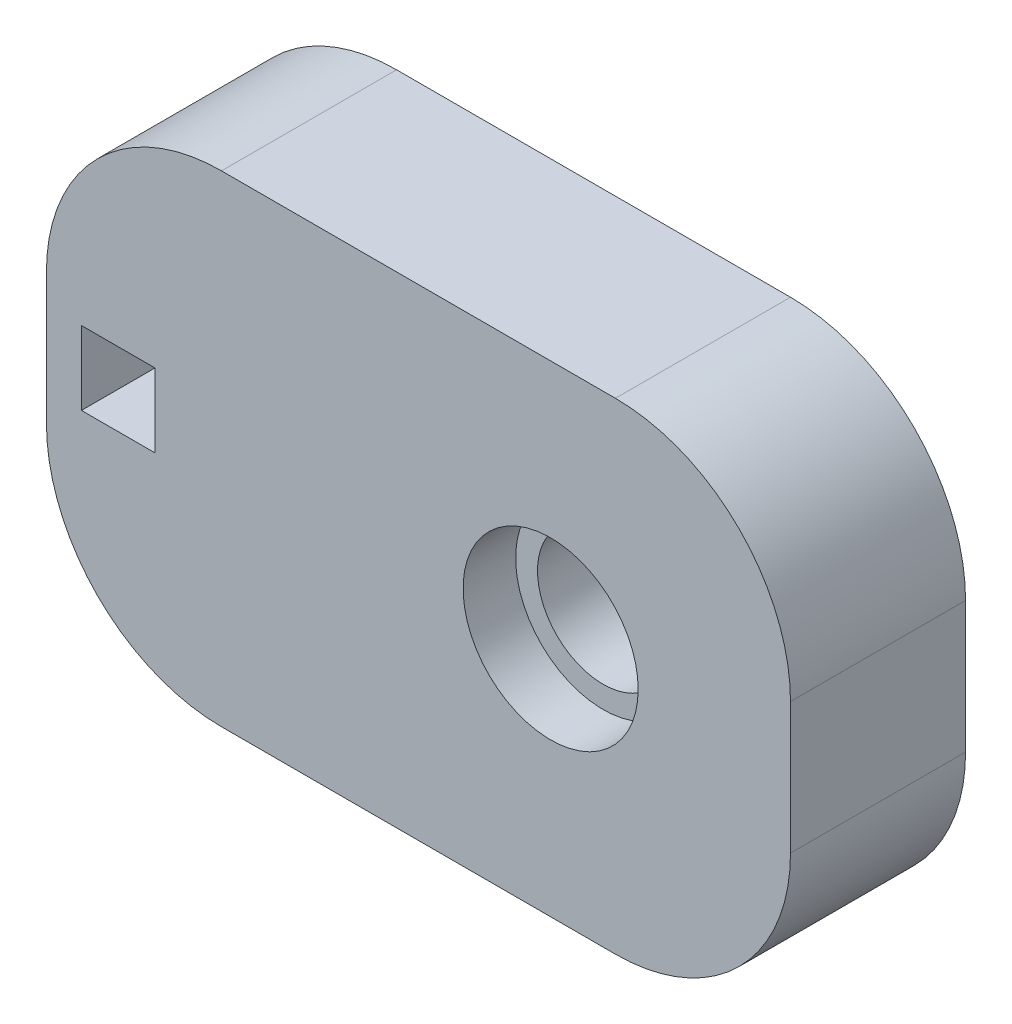
ISO-10303-21;
HEADER;
FILE_DESCRIPTION(('STEP AP214'),'2;1');
FILE_NAME('part.step','',(''),(''),'','','');
FILE_SCHEMA(('AUTOMOTIVE_DESIGN { 1 0 10303 214 1 1 1 1 }'));
ENDSEC;
DATA;
#1=APPLICATION_CONTEXT('core data for automotive mechanical design processes');
#2=APPLICATION_PROTOCOL_DEFINITION('international standard','automotive_design',2000,#1);
#3=PRODUCT_CONTEXT('',#1,'mechanical');
#4=PRODUCT('Part','Part','',(#3));
#5=PRODUCT_RELATED_PRODUCT_CATEGORY('part','',(#4));
#6=PRODUCT_DEFINITION_FORMATION('','',#4);
#7=PRODUCT_DEFINITION_CONTEXT('part definition',#1,'design');
#8=PRODUCT_DEFINITION('design','',#6,#7);
#9=PRODUCT_DEFINITION_SHAPE('','',#8);
#10=(LENGTH_UNIT() NAMED_UNIT(*) SI_UNIT(.MILLI.,.METRE.));
#11=(NAMED_UNIT(*) PLANE_ANGLE_UNIT() SI_UNIT($,.RADIAN.));
#12=(NAMED_UNIT(*) SI_UNIT($,.STERADIAN.) SOLID_ANGLE_UNIT());
#13=UNCERTAINTY_MEASURE_WITH_UNIT(LENGTH_MEASURE(1.E-05),#10,'distance_accuracy_value','');
#14=(GEOMETRIC_REPRESENTATION_CONTEXT(3) GLOBAL_UNCERTAINTY_ASSIGNED_CONTEXT((#13)) GLOBAL_UNIT_ASSIGNED_CONTEXT((#10,
#11,#12)) REPRESENTATION_CONTEXT('',''));
#15=CARTESIAN_POINT('',(0.,0.,0.));
#16=DIRECTION('',(0.,0.,1.));
#17=DIRECTION('',(1.,0.,0.));
#18=AXIS2_PLACEMENT_3D('',#15,#16,#17);
#19=CARTESIAN_POINT('',(303.925597792116,-212.008680098977,10.));
#20=DIRECTION('',(0.,1.,0.));
#21=DIRECTION('',(0.,0.,1.));
#22=AXIS2_PLACEMENT_3D('',#19,#20,#21);
#23=PLANE('',#22);
#24=DIRECTION('',(1.,0.,0.));
#25=VECTOR('',#24,1.);
#26=CARTESIAN_POINT('',(303.925597792116,-212.008680098977,10.));
#27=LINE('',#26,#25);
#28=CARTESIAN_POINT('',(313.925597792116,-212.008680098977,10.));
#29=VERTEX_POINT('',#28);
#30=CARTESIAN_POINT('',(336.425597792117,-212.008680098977,10.));
#31=VERTEX_POINT('',#30);
#32=EDGE_CURVE('E180',#29,#31,#27,.T.);
#33=ORIENTED_EDGE('',*,*,#32,.T.);
#34=DIRECTION('',(0.,0.,-1.));
#35=VECTOR('',#34,1.);
#36=CARTESIAN_POINT('',(336.425597792117,-212.008680098977,10.));
#37=LINE('',#36,#35);
#38=CARTESIAN_POINT('',(336.425597792117,-212.008680098977,0.));
#39=VERTEX_POINT('',#38);
#40=EDGE_CURVE('E230',#31,#39,#37,.T.);
#41=ORIENTED_EDGE('',*,*,#40,.T.);
#42=DIRECTION('',(1.,0.,0.));
#43=VECTOR('',#42,1.);
#44=CARTESIAN_POINT('',(303.925597792116,-212.008680098977,0.));
#45=LINE('',#44,#43);
#46=CARTESIAN_POINT('',(313.925597792116,-212.008680098977,0.));
#47=VERTEX_POINT('',#46);
#48=EDGE_CURVE('E177',#47,#39,#45,.T.);
#49=ORIENTED_EDGE('',*,*,#48,.F.);
#50=DIRECTION('',(0.,0.,-1.));
#51=VECTOR('',#50,1.);
#52=CARTESIAN_POINT('',(313.925597792116,-212.008680098977,10.));
#53=LINE('',#52,#51);
#54=EDGE_CURVE('E228',#47,#29,#53,.F.);
#55=ORIENTED_EDGE('',*,*,#54,.T.);
#56=EDGE_LOOP('',(#33,#41,#49,#55));
#57=FACE_BOUND('',#56,.T.);
#58=ADVANCED_FACE('F39',(#57),#23,.T.);
#59=CARTESIAN_POINT('',(303.925597792116,-212.008680098977,10.));
#60=DIRECTION('',(1.,0.,0.));
#61=DIRECTION('',(0.,0.,-1.));
#62=AXIS2_PLACEMENT_3D('',#59,#60,#61);
#63=PLANE('',#62);
#64=DIRECTION('',(0.,-1.,0.));
#65=VECTOR('',#64,1.);
#66=CARTESIAN_POINT('',(303.925597792116,-212.008680098977,0.));
#67=LINE('',#66,#65);
#68=CARTESIAN_POINT('',(303.925597792116,-222.008680098977,0.));
#69=VERTEX_POINT('',#68);
#70=CARTESIAN_POINT('',(303.925597792116,-229.508680098977,0.));
#71=VERTEX_POINT('',#70);
#72=EDGE_CURVE('E184',#69,#71,#67,.T.);
#73=ORIENTED_EDGE('',*,*,#72,.T.);
#74=DIRECTION('',(0.,0.,-1.));
#75=VECTOR('',#74,1.);
#76=CARTESIAN_POINT('',(303.925597792116,-229.508680098977,10.));
#77=LINE('',#76,#75);
#78=CARTESIAN_POINT('',(303.925597792116,-229.508680098977,10.));
#79=VERTEX_POINT('',#78);
#80=EDGE_CURVE('E12',#71,#79,#77,.F.);
#81=ORIENTED_EDGE('',*,*,#80,.T.);
#82=DIRECTION('',(0.,-1.,0.));
#83=VECTOR('',#82,1.);
#84=CARTESIAN_POINT('',(303.925597792116,-212.008680098977,10.));
#85=LINE('',#84,#83);
#86=CARTESIAN_POINT('',(303.925597792116,-222.008680098977,10.));
#87=VERTEX_POINT('',#86);
#88=EDGE_CURVE('E190',#87,#79,#85,.T.);
#89=ORIENTED_EDGE('',*,*,#88,.F.);
#90=DIRECTION('',(0.,0.,-1.));
#91=VECTOR('',#90,1.);
#92=CARTESIAN_POINT('',(303.925597792116,-222.008680098977,0.));
#93=LINE('',#92,#91);
#94=EDGE_CURVE('E47',#87,#69,#93,.T.);
#95=ORIENTED_EDGE('',*,*,#94,.T.);
#96=EDGE_LOOP('',(#73,#81,#89,#95));
#97=FACE_BOUND('',#96,.T.);
#98=ADVANCED_FACE('F235',(#97),#63,.F.);
#99=CARTESIAN_POINT('',(303.925597792116,-239.508680098977,10.));
#100=DIRECTION('',(0.,1.,0.));
#101=DIRECTION('',(0.,0.,1.));
#102=AXIS2_PLACEMENT_3D('',#99,#100,#101);
#103=PLANE('',#102);
#104=DIRECTION('',(1.,0.,0.));
#105=VECTOR('',#104,1.);
#106=CARTESIAN_POINT('',(303.925597792116,-239.508680098977,0.));
#107=LINE('',#106,#105);
#108=CARTESIAN_POINT('',(313.925597792116,-239.508680098977,0.));
#109=VERTEX_POINT('',#108);
#110=CARTESIAN_POINT('',(336.425597792117,-239.508680098977,0.));
#111=VERTEX_POINT('',#110);
#112=EDGE_CURVE('E198',#109,#111,#107,.T.);
#113=ORIENTED_EDGE('',*,*,#112,.T.);
#114=DIRECTION('',(0.,0.,-1.));
#115=VECTOR('',#114,1.);
#116=CARTESIAN_POINT('',(336.425597792117,-239.508680098977,10.));
#117=LINE('',#116,#115);
#118=CARTESIAN_POINT('',(336.425597792117,-239.508680098977,10.));
#119=VERTEX_POINT('',#118);
#120=EDGE_CURVE('E219',#111,#119,#117,.F.);
#121=ORIENTED_EDGE('',*,*,#120,.T.);
#122=DIRECTION('',(1.,0.,0.));
#123=VECTOR('',#122,1.);
#124=CARTESIAN_POINT('',(303.925597792116,-239.508680098977,10.));
#125=LINE('',#124,#123);
#126=CARTESIAN_POINT('',(313.925597792116,-239.508680098977,10.));
#127=VERTEX_POINT('',#126);
#128=EDGE_CURVE('E187',#127,#119,#125,.T.);
#129=ORIENTED_EDGE('',*,*,#128,.F.);
#130=DIRECTION('',(0.,0.,-1.));
#131=VECTOR('',#130,1.);
#132=CARTESIAN_POINT('',(313.925597792116,-239.508680098977,10.));
#133=LINE('',#132,#131);
#134=EDGE_CURVE('E216',#127,#109,#133,.T.);
#135=ORIENTED_EDGE('',*,*,#134,.T.);
#136=EDGE_LOOP('',(#113,#121,#129,#135));
#137=FACE_BOUND('',#136,.T.);
#138=ADVANCED_FACE('F247',(#137),#103,.F.);
#139=CARTESIAN_POINT('',(346.425597792117,-212.008680098977,10.));
#140=DIRECTION('',(1.,0.,0.));
#141=DIRECTION('',(0.,0.,-1.));
#142=AXIS2_PLACEMENT_3D('',#139,#140,#141);
#143=PLANE('',#142);
#144=DIRECTION('',(0.,-1.,0.));
#145=VECTOR('',#144,1.);
#146=CARTESIAN_POINT('',(346.425597792117,-212.008680098977,10.));
#147=LINE('',#146,#145);
#148=CARTESIAN_POINT('',(346.425597792117,-222.008680098977,10.));
#149=VERTEX_POINT('',#148);
#150=CARTESIAN_POINT('',(346.425597792117,-229.508680098977,10.));
#151=VERTEX_POINT('',#150);
#152=EDGE_CURVE('E183',#149,#151,#147,.T.);
#153=ORIENTED_EDGE('',*,*,#152,.T.);
#154=DIRECTION('',(0.,0.,-1.));
#155=VECTOR('',#154,1.);
#156=CARTESIAN_POINT('',(346.425597792117,-229.508680098977,0.));
#157=LINE('',#156,#155);
#158=CARTESIAN_POINT('',(346.425597792117,-229.508680098977,0.));
#159=VERTEX_POINT('',#158);
#160=EDGE_CURVE('E205',#151,#159,#157,.T.);
#161=ORIENTED_EDGE('',*,*,#160,.T.);
#162=DIRECTION('',(0.,-1.,0.));
#163=VECTOR('',#162,1.);
#164=CARTESIAN_POINT('',(346.425597792117,-212.008680098977,0.));
#165=LINE('',#164,#163);
#166=CARTESIAN_POINT('',(346.425597792117,-222.008680098977,0.));
#167=VERTEX_POINT('',#166);
#168=EDGE_CURVE('E195',#167,#159,#165,.T.);
#169=ORIENTED_EDGE('',*,*,#168,.F.);
#170=DIRECTION('',(0.,0.,-1.));
#171=VECTOR('',#170,1.);
#172=CARTESIAN_POINT('',(346.425597792117,-222.008680098977,10.));
#173=LINE('',#172,#171);
#174=EDGE_CURVE('E192',#167,#149,#173,.F.);
#175=ORIENTED_EDGE('',*,*,#174,.T.);
#176=EDGE_LOOP('',(#153,#161,#169,#175));
#177=FACE_BOUND('',#176,.T.);
#178=ADVANCED_FACE('F257',(#177),#143,.T.);
#179=CARTESIAN_POINT('',(0.,0.,10.));
#180=DIRECTION('',(0.,0.,-1.));
#181=DIRECTION('',(-1.,0.,0.));
#182=AXIS2_PLACEMENT_3D('',#179,#180,#181);
#183=PLANE('',#182);
#184=DIRECTION('',(1.,0.,0.));
#185=VECTOR('',#184,1.);
#186=CARTESIAN_POINT('',(305.925597792116,-227.858680098977,10.));
#187=LINE('',#186,#185);
#188=CARTESIAN_POINT('',(305.925597792116,-227.858680098977,10.));
#189=VERTEX_POINT('',#188);
#190=CARTESIAN_POINT('',(310.125597792116,-227.858680098977,10.));
#191=VERTEX_POINT('',#190);
#192=EDGE_CURVE('E163',#189,#191,#187,.T.);
#193=ORIENTED_EDGE('',*,*,#192,.F.);
#194=DIRECTION('',(0.,-1.,0.));
#195=VECTOR('',#194,1.);
#196=CARTESIAN_POINT('',(305.925597792116,-223.658680098977,10.));
#197=LINE('',#196,#195);
#198=CARTESIAN_POINT('',(305.925597792116,-223.658680098977,10.));
#199=VERTEX_POINT('',#198);
#200=EDGE_CURVE('E135',#199,#189,#197,.T.);
#201=ORIENTED_EDGE('',*,*,#200,.F.);
#202=DIRECTION('',(-1.,0.,0.));
#203=VECTOR('',#202,1.);
#204=CARTESIAN_POINT('',(310.125597792116,-223.658680098977,10.));
#205=LINE('',#204,#203);
#206=CARTESIAN_POINT('',(310.125597792116,-223.658680098977,10.));
#207=VERTEX_POINT('',#206);
#208=EDGE_CURVE('E152',#207,#199,#205,.T.);
#209=ORIENTED_EDGE('',*,*,#208,.F.);
#210=DIRECTION('',(0.,1.,0.));
#211=VECTOR('',#210,1.);
#212=CARTESIAN_POINT('',(310.125597792116,-227.858680098977,10.));
#213=LINE('',#212,#211);
#214=EDGE_CURVE('E155',#191,#207,#213,.T.);
#215=ORIENTED_EDGE('',*,*,#214,.F.);
#216=EDGE_LOOP('',(#193,#201,#209,#215));
#217=FACE_BOUND('',#216,.T.);
#218=CARTESIAN_POINT('',(332.725597792119,-225.758680098977,10.));
#219=DIRECTION('',(0.,0.,1.));
#220=DIRECTION('',(1.,0.,0.));
#221=AXIS2_PLACEMENT_3D('',#218,#219,#220);
#222=CIRCLE('',#221,4.9999999999961);
#223=CARTESIAN_POINT('',(337.725597792115,-225.758680098977,10.));
#224=VERTEX_POINT('',#223);
#225=EDGE_CURVE('E170',#224,#224,#222,.T.);
#226=ORIENTED_EDGE('',*,*,#225,.F.);
#227=EDGE_LOOP('',(#226));
#228=FACE_BOUND('',#227,.T.);
#229=ORIENTED_EDGE('',*,*,#128,.T.);
#230=CARTESIAN_POINT('',(336.425597792117,-229.508680098977,10.));
#231=DIRECTION('',(0.,0.,-1.));
#232=DIRECTION('',(-1.,0.,0.));
#233=AXIS2_PLACEMENT_3D('',#230,#231,#232);
#234=CIRCLE('',#233,10.);
#235=EDGE_CURVE('E226',#119,#151,#234,.F.);
#236=ORIENTED_EDGE('',*,*,#235,.T.);
#237=ORIENTED_EDGE('',*,*,#152,.F.);
#238=CARTESIAN_POINT('',(336.425597792117,-222.008680098977,10.));
#239=DIRECTION('',(0.,0.,-1.));
#240=DIRECTION('',(-1.,0.,0.));
#241=AXIS2_PLACEMENT_3D('',#238,#239,#240);
#242=CIRCLE('',#241,10.);
#243=EDGE_CURVE('E224',#149,#31,#242,.F.);
#244=ORIENTED_EDGE('',*,*,#243,.T.);
#245=ORIENTED_EDGE('',*,*,#32,.F.);
#246=CARTESIAN_POINT('',(313.925597792116,-222.008680098977,10.));
#247=DIRECTION('',(0.,0.,-1.));
#248=DIRECTION('',(-1.,0.,0.));
#249=AXIS2_PLACEMENT_3D('',#246,#247,#248);
#250=CIRCLE('',#249,10.);
#251=EDGE_CURVE('E59',#29,#87,#250,.F.);
#252=ORIENTED_EDGE('',*,*,#251,.T.);
#253=ORIENTED_EDGE('',*,*,#88,.T.);
#254=CARTESIAN_POINT('',(313.925597792116,-229.508680098977,10.));
#255=DIRECTION('',(0.,0.,-1.));
#256=DIRECTION('',(-1.,0.,0.));
#257=AXIS2_PLACEMENT_3D('',#254,#255,#256);
#258=CIRCLE('',#257,10.);
#259=EDGE_CURVE('E222',#79,#127,#258,.F.);
#260=ORIENTED_EDGE('',*,*,#259,.T.);
#261=EDGE_LOOP('',(#229,#236,#237,#244,#245,#252,#253,#260));
#262=FACE_BOUND('',#261,.T.);
#263=ADVANCED_FACE('F250',(#217,#228,#262),#183,.F.);
#264=CARTESIAN_POINT('',(0.,0.,0.));
#265=DIRECTION('',(0.,0.,-1.));
#266=DIRECTION('',(-1.,0.,0.));
#267=AXIS2_PLACEMENT_3D('',#264,#265,#266);
#268=PLANE('',#267);
#269=ORIENTED_EDGE('',*,*,#168,.T.);
#270=CARTESIAN_POINT('',(336.425597792117,-229.508680098977,0.));
#271=DIRECTION('',(0.,0.,-1.));
#272=DIRECTION('',(-1.,0.,0.));
#273=AXIS2_PLACEMENT_3D('',#270,#271,#272);
#274=CIRCLE('',#273,10.);
#275=EDGE_CURVE('E214',#159,#111,#274,.T.);
#276=ORIENTED_EDGE('',*,*,#275,.T.);
#277=ORIENTED_EDGE('',*,*,#112,.F.);
#278=CARTESIAN_POINT('',(313.925597792116,-229.508680098977,0.));
#279=DIRECTION('',(0.,0.,-1.));
#280=DIRECTION('',(-1.,0.,0.));
#281=AXIS2_PLACEMENT_3D('',#278,#279,#280);
#282=CIRCLE('',#281,10.);
#283=EDGE_CURVE('E210',#109,#71,#282,.T.);
#284=ORIENTED_EDGE('',*,*,#283,.T.);
#285=ORIENTED_EDGE('',*,*,#72,.F.);
#286=CARTESIAN_POINT('',(313.925597792116,-222.008680098977,0.));
#287=DIRECTION('',(0.,0.,-1.));
#288=DIRECTION('',(-1.,0.,0.));
#289=AXIS2_PLACEMENT_3D('',#286,#287,#288);
#290=CIRCLE('',#289,10.);
#291=EDGE_CURVE('E208',#69,#47,#290,.T.);
#292=ORIENTED_EDGE('',*,*,#291,.T.);
#293=ORIENTED_EDGE('',*,*,#48,.T.);
#294=CARTESIAN_POINT('',(336.425597792117,-222.008680098977,0.));
#295=DIRECTION('',(0.,0.,-1.));
#296=DIRECTION('',(-1.,0.,0.));
#297=AXIS2_PLACEMENT_3D('',#294,#295,#296);
#298=CIRCLE('',#297,10.);
#299=EDGE_CURVE('E212',#39,#167,#298,.T.);
#300=ORIENTED_EDGE('',*,*,#299,.T.);
#301=EDGE_LOOP('',(#269,#276,#277,#284,#285,#292,#293,#300));
#302=FACE_BOUND('',#301,.T.);
#303=ADVANCED_FACE('F238',(#302),#268,.T.);
#304=CARTESIAN_POINT('',(332.725597792119,-225.758680098977,7.));
#305=DIRECTION('',(0.,0.,1.));
#306=DIRECTION('',(1.,0.,0.));
#307=AXIS2_PLACEMENT_3D('',#304,#305,#306);
#308=CYLINDRICAL_SURFACE('',#307,4.9999999999961);
#309=CARTESIAN_POINT('',(332.725597792119,-225.758680098977,7.));
#310=DIRECTION('',(0.,0.,1.));
#311=DIRECTION('',(1.,0.,0.));
#312=AXIS2_PLACEMENT_3D('',#309,#310,#311);
#313=CIRCLE('',#312,4.9999999999961);
#314=CARTESIAN_POINT('',(337.725597792115,-225.758680098977,7.));
#315=VERTEX_POINT('',#314);
#316=EDGE_CURVE('E174',#315,#315,#313,.T.);
#317=ORIENTED_EDGE('',*,*,#316,.F.);
#318=EDGE_LOOP('',(#317));
#319=FACE_BOUND('',#318,.T.);
#320=ORIENTED_EDGE('',*,*,#225,.T.);
#321=EDGE_LOOP('',(#320));
#322=FACE_BOUND('',#321,.T.);
#323=ADVANCED_FACE('F380',(#319,#322),#308,.F.);
#324=CARTESIAN_POINT('',(332.725597792119,-225.758680098977,7.));
#325=DIRECTION('',(0.,0.,1.));
#326=DIRECTION('',(1.,0.,0.));
#327=AXIS2_PLACEMENT_3D('',#324,#325,#326);
#328=PLANE('',#327);
#329=CARTESIAN_POINT('',(332.725597792119,-225.758680098977,7.));
#330=DIRECTION('',(0.,0.,1.));
#331=DIRECTION('',(1.,0.,0.));
#332=AXIS2_PLACEMENT_3D('',#329,#330,#331);
#333=CIRCLE('',#332,3.74999999999998);
#334=CARTESIAN_POINT('',(336.475597792119,-225.758680098977,7.));
#335=VERTEX_POINT('',#334);
#336=EDGE_CURVE('E164',#335,#335,#333,.T.);
#337=ORIENTED_EDGE('',*,*,#336,.F.);
#338=EDGE_LOOP('',(#337));
#339=FACE_BOUND('',#338,.T.);
#340=ORIENTED_EDGE('',*,*,#316,.T.);
#341=EDGE_LOOP('',(#340));
#342=FACE_BOUND('',#341,.T.);
#343=ADVANCED_FACE('F371',(#339,#342),#328,.T.);
#344=CARTESIAN_POINT('',(305.925597792116,-223.658680098977,5.));
#345=DIRECTION('',(-1.,0.,0.));
#346=DIRECTION('',(0.,0.,1.));
#347=AXIS2_PLACEMENT_3D('',#344,#345,#346);
#348=PLANE('',#347);
#349=ORIENTED_EDGE('',*,*,#200,.T.);
#350=DIRECTION('',(0.,0.,1.));
#351=VECTOR('',#350,1.);
#352=CARTESIAN_POINT('',(305.925597792116,-227.858680098977,5.));
#353=LINE('',#352,#351);
#354=CARTESIAN_POINT('',(305.925597792116,-227.858680098977,5.));
#355=VERTEX_POINT('',#354);
#356=EDGE_CURVE('E128',#355,#189,#353,.T.);
#357=ORIENTED_EDGE('',*,*,#356,.F.);
#358=DIRECTION('',(0.,-1.,0.));
#359=VECTOR('',#358,1.);
#360=CARTESIAN_POINT('',(305.925597792116,-223.658680098977,5.));
#361=LINE('',#360,#359);
#362=CARTESIAN_POINT('',(305.925597792116,-223.658680098977,5.));
#363=VERTEX_POINT('',#362);
#364=EDGE_CURVE('E132',#363,#355,#361,.T.);
#365=ORIENTED_EDGE('',*,*,#364,.F.);
#366=DIRECTION('',(0.,0.,1.));
#367=VECTOR('',#366,1.);
#368=CARTESIAN_POINT('',(305.925597792116,-223.658680098977,5.));
#369=LINE('',#368,#367);
#370=EDGE_CURVE('E168',#363,#199,#369,.T.);
#371=ORIENTED_EDGE('',*,*,#370,.T.);
#372=EDGE_LOOP('',(#349,#357,#365,#371));
#373=FACE_BOUND('',#372,.T.);
#374=ADVANCED_FACE('F130',(#373),#348,.F.);
#375=CARTESIAN_POINT('',(310.125597792116,-223.658680098977,5.));
#376=DIRECTION('',(0.,1.,0.));
#377=DIRECTION('',(0.,0.,1.));
#378=AXIS2_PLACEMENT_3D('',#375,#376,#377);
#379=PLANE('',#378);
#380=ORIENTED_EDGE('',*,*,#208,.T.);
#381=ORIENTED_EDGE('',*,*,#370,.F.);
#382=DIRECTION('',(-1.,0.,0.));
#383=VECTOR('',#382,1.);
#384=CARTESIAN_POINT('',(310.125597792116,-223.658680098977,5.));
#385=LINE('',#384,#383);
#386=CARTESIAN_POINT('',(310.125597792116,-223.658680098977,5.));
#387=VERTEX_POINT('',#386);
#388=EDGE_CURVE('E140',#387,#363,#385,.T.);
#389=ORIENTED_EDGE('',*,*,#388,.F.);
#390=DIRECTION('',(0.,0.,1.));
#391=VECTOR('',#390,1.);
#392=CARTESIAN_POINT('',(310.125597792116,-223.658680098977,5.));
#393=LINE('',#392,#391);
#394=EDGE_CURVE('E171',#387,#207,#393,.T.);
#395=ORIENTED_EDGE('',*,*,#394,.T.);
#396=EDGE_LOOP('',(#380,#381,#389,#395));
#397=FACE_BOUND('',#396,.T.);
#398=ADVANCED_FACE('F352',(#397),#379,.F.);
#399=CARTESIAN_POINT('',(310.125597792116,-227.858680098977,5.));
#400=DIRECTION('',(1.,0.,0.));
#401=DIRECTION('',(0.,0.,-1.));
#402=AXIS2_PLACEMENT_3D('',#399,#400,#401);
#403=PLANE('',#402);
#404=ORIENTED_EDGE('',*,*,#214,.T.);
#405=ORIENTED_EDGE('',*,*,#394,.F.);
#406=DIRECTION('',(0.,1.,0.));
#407=VECTOR('',#406,1.);
#408=CARTESIAN_POINT('',(310.125597792116,-227.858680098977,5.));
#409=LINE('',#408,#407);
#410=CARTESIAN_POINT('',(310.125597792116,-227.858680098977,5.));
#411=VERTEX_POINT('',#410);
#412=EDGE_CURVE('E148',#411,#387,#409,.T.);
#413=ORIENTED_EDGE('',*,*,#412,.F.);
#414=DIRECTION('',(0.,0.,1.));
#415=VECTOR('',#414,1.);
#416=CARTESIAN_POINT('',(310.125597792116,-227.858680098977,5.));
#417=LINE('',#416,#415);
#418=EDGE_CURVE('E139',#411,#191,#417,.T.);
#419=ORIENTED_EDGE('',*,*,#418,.T.);
#420=EDGE_LOOP('',(#404,#405,#413,#419));
#421=FACE_BOUND('',#420,.T.);
#422=ADVANCED_FACE('F343',(#421),#403,.F.);
#423=CARTESIAN_POINT('',(305.925597792116,-227.858680098977,5.));
#424=DIRECTION('',(0.,-1.,0.));
#425=DIRECTION('',(0.,0.,-1.));
#426=AXIS2_PLACEMENT_3D('',#423,#424,#425);
#427=PLANE('',#426);
#428=ORIENTED_EDGE('',*,*,#192,.T.);
#429=ORIENTED_EDGE('',*,*,#418,.F.);
#430=DIRECTION('',(1.,0.,0.));
#431=VECTOR('',#430,1.);
#432=CARTESIAN_POINT('',(305.925597792116,-227.858680098977,5.));
#433=LINE('',#432,#431);
#434=EDGE_CURVE('E143',#355,#411,#433,.T.);
#435=ORIENTED_EDGE('',*,*,#434,.F.);
#436=ORIENTED_EDGE('',*,*,#356,.T.);
#437=EDGE_LOOP('',(#428,#429,#435,#436));
#438=FACE_BOUND('',#437,.T.);
#439=ADVANCED_FACE('F144',(#438),#427,.F.);
#440=CARTESIAN_POINT('',(0.,0.,5.));
#441=DIRECTION('',(0.,0.,1.));
#442=DIRECTION('',(1.,0.,0.));
#443=AXIS2_PLACEMENT_3D('',#440,#441,#442);
#444=PLANE('',#443);
#445=ORIENTED_EDGE('',*,*,#364,.T.);
#446=ORIENTED_EDGE('',*,*,#434,.T.);
#447=ORIENTED_EDGE('',*,*,#412,.T.);
#448=ORIENTED_EDGE('',*,*,#388,.T.);
#449=EDGE_LOOP('',(#445,#446,#447,#448));
#450=FACE_BOUND('',#449,.T.);
#451=ADVANCED_FACE('F150',(#450),#444,.T.);
#452=CARTESIAN_POINT('',(0.,0.,2.5));
#453=DIRECTION('',(0.,0.,-1.));
#454=DIRECTION('',(-1.,0.,0.));
#455=AXIS2_PLACEMENT_3D('',#452,#453,#454);
#456=PLANE('',#455);
#457=CARTESIAN_POINT('',(332.725597792119,-225.758680098977,2.5));
#458=DIRECTION('',(0.,0.,-1.));
#459=DIRECTION('',(-1.,0.,0.));
#460=AXIS2_PLACEMENT_3D('',#457,#458,#459);
#461=CIRCLE('',#460,3.74999999999998);
#462=CARTESIAN_POINT('',(328.975597792119,-225.758680098977,2.5));
#463=VERTEX_POINT('',#462);
#464=EDGE_CURVE('E158',#463,#463,#461,.F.);
#465=ORIENTED_EDGE('',*,*,#464,.T.);
#466=EDGE_LOOP('',(#465));
#467=FACE_BOUND('',#466,.T.);
#468=ADVANCED_FACE('F316',(#467),#456,.F.);
#469=CARTESIAN_POINT('',(332.725597792119,-225.758680098977,-10.6066017177981));
#470=DIRECTION('',(0.,0.,1.));
#471=DIRECTION('',(1.,0.,0.));
#472=AXIS2_PLACEMENT_3D('',#469,#470,#471);
#473=CYLINDRICAL_SURFACE('',#472,3.74999999999998);
#474=ORIENTED_EDGE('',*,*,#336,.T.);
#475=EDGE_LOOP('',(#474));
#476=FACE_BOUND('',#475,.T.);
#477=ORIENTED_EDGE('',*,*,#464,.F.);
#478=EDGE_LOOP('',(#477));
#479=FACE_BOUND('',#478,.T.);
#480=ADVANCED_FACE('F280',(#476,#479),#473,.F.);
#481=CARTESIAN_POINT('',(336.425597792117,-229.508680098977,10.));
#482=DIRECTION('',(0.,0.,1.));
#483=DIRECTION('',(1.,0.,0.));
#484=AXIS2_PLACEMENT_3D('',#481,#482,#483);
#485=CYLINDRICAL_SURFACE('',#484,10.);
#486=ORIENTED_EDGE('',*,*,#235,.F.);
#487=ORIENTED_EDGE('',*,*,#120,.F.);
#488=ORIENTED_EDGE('',*,*,#275,.F.);
#489=ORIENTED_EDGE('',*,*,#160,.F.);
#490=EDGE_LOOP('',(#486,#487,#488,#489));
#491=FACE_BOUND('',#490,.T.);
#492=ADVANCED_FACE('F254',(#491),#485,.T.);
#493=CARTESIAN_POINT('',(336.425597792117,-222.008680098977,10.));
#494=DIRECTION('',(0.,0.,-1.));
#495=DIRECTION('',(-1.,0.,0.));
#496=AXIS2_PLACEMENT_3D('',#493,#494,#495);
#497=CYLINDRICAL_SURFACE('',#496,10.);
#498=ORIENTED_EDGE('',*,*,#243,.F.);
#499=ORIENTED_EDGE('',*,*,#174,.F.);
#500=ORIENTED_EDGE('',*,*,#299,.F.);
#501=ORIENTED_EDGE('',*,*,#40,.F.);
#502=EDGE_LOOP('',(#498,#499,#500,#501));
#503=FACE_BOUND('',#502,.T.);
#504=ADVANCED_FACE('F262',(#503),#497,.T.);
#505=CARTESIAN_POINT('',(313.925597792116,-229.508680098977,10.));
#506=DIRECTION('',(0.,0.,-1.));
#507=DIRECTION('',(-1.,0.,0.));
#508=AXIS2_PLACEMENT_3D('',#505,#506,#507);
#509=CYLINDRICAL_SURFACE('',#508,10.);
#510=ORIENTED_EDGE('',*,*,#259,.F.);
#511=ORIENTED_EDGE('',*,*,#80,.F.);
#512=ORIENTED_EDGE('',*,*,#283,.F.);
#513=ORIENTED_EDGE('',*,*,#134,.F.);
#514=EDGE_LOOP('',(#510,#511,#512,#513));
#515=FACE_BOUND('',#514,.T.);
#516=ADVANCED_FACE('F244',(#515),#509,.T.);
#517=CARTESIAN_POINT('',(313.925597792116,-222.008680098977,10.));
#518=DIRECTION('',(0.,0.,1.));
#519=DIRECTION('',(1.,0.,0.));
#520=AXIS2_PLACEMENT_3D('',#517,#518,#519);
#521=CYLINDRICAL_SURFACE('',#520,10.);
#522=ORIENTED_EDGE('',*,*,#251,.F.);
#523=ORIENTED_EDGE('',*,*,#54,.F.);
#524=ORIENTED_EDGE('',*,*,#291,.F.);
#525=ORIENTED_EDGE('',*,*,#94,.F.);
#526=EDGE_LOOP('',(#522,#523,#524,#525));
#527=FACE_BOUND('',#526,.T.);
#528=ADVANCED_FACE('F41',(#527),#521,.T.);
#529=CLOSED_SHELL('',(#58,#98,#138,#178,#263,#303,#323,#343,#374,#398,#422,#439,#451,#468,#480,
#492,#504,#516,#528));
#530=MANIFOLD_SOLID_BREP('B2',#529);
#531=ADVANCED_BREP_SHAPE_REPRESENTATION('',(#18,#530),#14);
#532=SHAPE_DEFINITION_REPRESENTATION(#9,#531);
ENDSEC;
END-ISO-10303-21;
